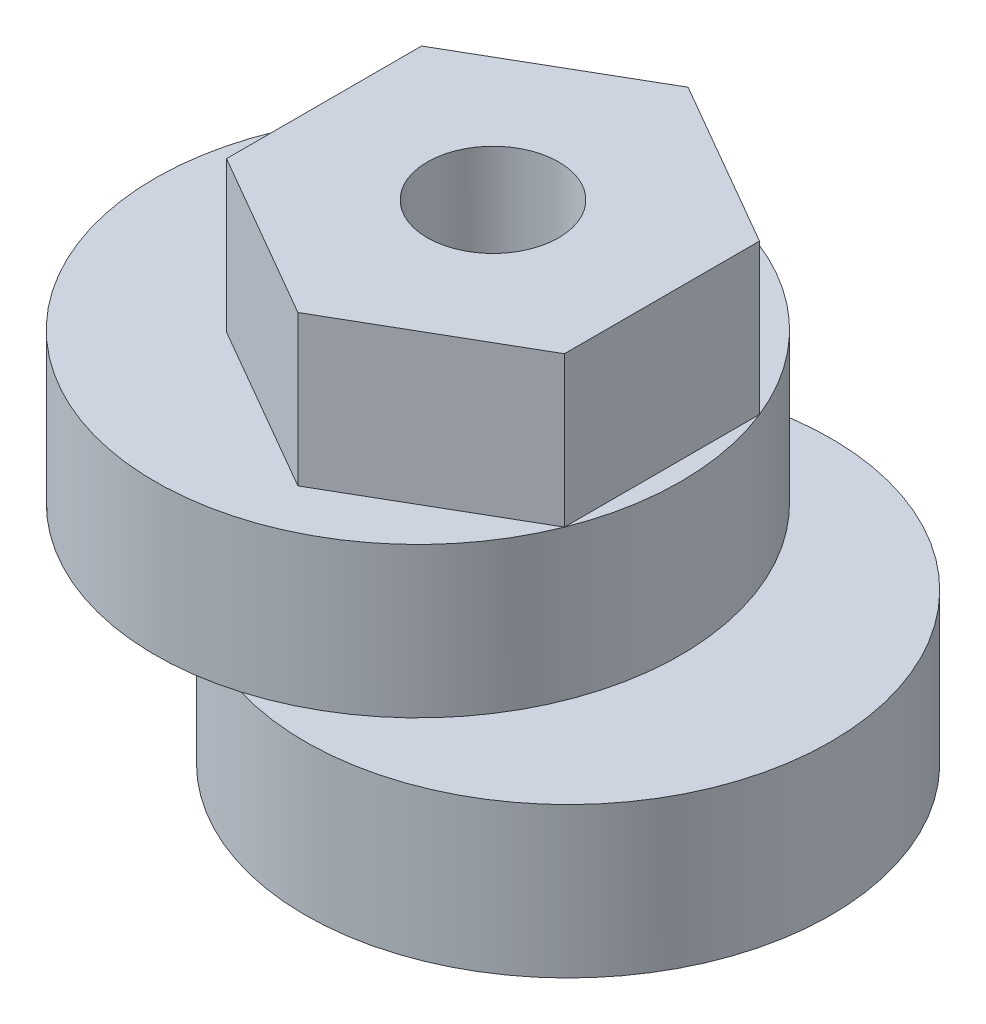
ISO-10303-21;
HEADER;
FILE_DESCRIPTION(('STEP AP214'),'2;1');
FILE_NAME('part.step','',(''),(''),'','','');
FILE_SCHEMA(('AUTOMOTIVE_DESIGN { 1 0 10303 214 1 1 1 1 }'));
ENDSEC;
DATA;
#1=APPLICATION_CONTEXT('core data for automotive mechanical design processes');
#2=APPLICATION_PROTOCOL_DEFINITION('international standard','automotive_design',2000,#1);
#3=PRODUCT_CONTEXT('',#1,'mechanical');
#4=PRODUCT('Part','Part','',(#3));
#5=PRODUCT_RELATED_PRODUCT_CATEGORY('part','',(#4));
#6=PRODUCT_DEFINITION_FORMATION('','',#4);
#7=PRODUCT_DEFINITION_CONTEXT('part definition',#1,'design');
#8=PRODUCT_DEFINITION('design','',#6,#7);
#9=PRODUCT_DEFINITION_SHAPE('','',#8);
#10=(LENGTH_UNIT() NAMED_UNIT(*) SI_UNIT(.MILLI.,.METRE.));
#11=(NAMED_UNIT(*) PLANE_ANGLE_UNIT() SI_UNIT($,.RADIAN.));
#12=(NAMED_UNIT(*) SI_UNIT($,.STERADIAN.) SOLID_ANGLE_UNIT());
#13=UNCERTAINTY_MEASURE_WITH_UNIT(LENGTH_MEASURE(1.E-05),#10,'distance_accuracy_value','');
#14=(GEOMETRIC_REPRESENTATION_CONTEXT(3) GLOBAL_UNCERTAINTY_ASSIGNED_CONTEXT((#13)) GLOBAL_UNIT_ASSIGNED_CONTEXT((#10,
#11,#12)) REPRESENTATION_CONTEXT('',''));
#15=CARTESIAN_POINT('',(0.,0.,0.));
#16=DIRECTION('',(0.,0.,1.));
#17=DIRECTION('',(1.,0.,0.));
#18=AXIS2_PLACEMENT_3D('',#15,#16,#17);
#19=CARTESIAN_POINT('',(-2.,10.,0.));
#20=DIRECTION('',(0.,1.,0.));
#21=DIRECTION('',(0.,0.,1.));
#22=AXIS2_PLACEMENT_3D('',#19,#20,#21);
#23=PLANE('',#22);
#24=DIRECTION('',(-0.866025403784439,0.,0.5));
#25=VECTOR('',#24,1.);
#26=CARTESIAN_POINT('',(0.,10.,-5.19615242270663));
#27=LINE('',#26,#25);
#28=CARTESIAN_POINT('',(0.,10.,-5.19615242270663));
#29=VERTEX_POINT('',#28);
#30=CARTESIAN_POINT('',(-4.5,10.,-2.59807621135332));
#31=VERTEX_POINT('',#30);
#32=EDGE_CURVE('E54',#29,#31,#27,.T.);
#33=ORIENTED_EDGE('',*,*,#32,.F.);
#34=DIRECTION('',(-0.866025403784439,0.,-0.5));
#35=VECTOR('',#34,1.);
#36=CARTESIAN_POINT('',(4.5,10.,-2.59807621135332));
#37=LINE('',#36,#35);
#38=CARTESIAN_POINT('',(4.5,10.,-2.59807621135332));
#39=VERTEX_POINT('',#38);
#40=EDGE_CURVE('E122',#39,#29,#37,.T.);
#41=ORIENTED_EDGE('',*,*,#40,.F.);
#42=CARTESIAN_POINT('',(-2.,10.,0.));
#43=DIRECTION('',(0.,1.,0.));
#44=DIRECTION('',(0.,0.,1.));
#45=AXIS2_PLACEMENT_3D('',#42,#43,#44);
#46=CIRCLE('',#45,7.);
#47=CARTESIAN_POINT('',(4.5,10.,2.59807621135332));
#48=VERTEX_POINT('',#47);
#49=EDGE_CURVE('E138',#39,#48,#46,.T.);
#50=ORIENTED_EDGE('',*,*,#49,.T.);
#51=DIRECTION('',(0.866025403784439,0.,-0.499999999999999));
#52=VECTOR('',#51,1.);
#53=CARTESIAN_POINT('',(0.,10.,5.19615242270663));
#54=LINE('',#53,#52);
#55=CARTESIAN_POINT('',(0.,10.,5.19615242270663));
#56=VERTEX_POINT('',#55);
#57=EDGE_CURVE('E61',#56,#48,#54,.T.);
#58=ORIENTED_EDGE('',*,*,#57,.F.);
#59=DIRECTION('',(0.866025403784439,0.,0.5));
#60=VECTOR('',#59,1.);
#61=CARTESIAN_POINT('',(-4.5,10.,2.59807621135332));
#62=LINE('',#61,#60);
#63=CARTESIAN_POINT('',(-4.5,10.,2.59807621135332));
#64=VERTEX_POINT('',#63);
#65=EDGE_CURVE('E397',#64,#56,#62,.T.);
#66=ORIENTED_EDGE('',*,*,#65,.F.);
#67=DIRECTION('',(0.,0.,1.));
#68=VECTOR('',#67,1.);
#69=CARTESIAN_POINT('',(-4.5,10.,-2.59807621135332));
#70=LINE('',#69,#68);
#71=EDGE_CURVE('E386',#31,#64,#70,.T.);
#72=ORIENTED_EDGE('',*,*,#71,.F.);
#73=EDGE_LOOP('',(#33,#41,#50,#58,#66,#72));
#74=FACE_BOUND('',#73,.T.);
#75=ADVANCED_FACE('F39',(#74),#23,.T.);
#76=CARTESIAN_POINT('',(0.,2.,0.));
#77=DIRECTION('',(0.,-1.,0.));
#78=DIRECTION('',(0.,0.,-1.));
#79=AXIS2_PLACEMENT_3D('',#76,#77,#78);
#80=CYLINDRICAL_SURFACE('',#79,5.);
#81=CARTESIAN_POINT('',(0.,2.,0.));
#82=DIRECTION('',(0.,1.,0.));
#83=DIRECTION('',(0.,0.,1.));
#84=AXIS2_PLACEMENT_3D('',#81,#82,#83);
#85=CIRCLE('',#84,5.);
#86=CARTESIAN_POINT('',(-5.,2.,0.));
#87=VERTEX_POINT('',#86);
#88=EDGE_CURVE('E11',#87,#87,#85,.T.);
#89=ORIENTED_EDGE('',*,*,#88,.F.);
#90=EDGE_LOOP('',(#89));
#91=FACE_BOUND('',#90,.T.);
#92=CARTESIAN_POINT('',(0.,0.,0.));
#93=DIRECTION('',(0.,1.,0.));
#94=DIRECTION('',(0.,0.,1.));
#95=AXIS2_PLACEMENT_3D('',#92,#93,#94);
#96=CIRCLE('',#95,5.);
#97=CARTESIAN_POINT('',(0.,0.,5.));
#98=VERTEX_POINT('',#97);
#99=EDGE_CURVE('E43',#98,#98,#96,.T.);
#100=ORIENTED_EDGE('',*,*,#99,.T.);
#101=EDGE_LOOP('',(#100));
#102=FACE_BOUND('',#101,.T.);
#103=ADVANCED_FACE('F41',(#91,#102),#80,.T.);
#104=CARTESIAN_POINT('',(0.,0.,0.));
#105=DIRECTION('',(0.,1.,0.));
#106=DIRECTION('',(0.,0.,1.));
#107=AXIS2_PLACEMENT_3D('',#104,#105,#106);
#108=PLANE('',#107);
#109=CARTESIAN_POINT('',(0.,0.,0.));
#110=DIRECTION('',(0.,-1.,0.));
#111=DIRECTION('',(0.,0.,-1.));
#112=AXIS2_PLACEMENT_3D('',#109,#110,#111);
#113=CIRCLE('',#112,1.75);
#114=CARTESIAN_POINT('',(0.,0.,-1.75));
#115=VERTEX_POINT('',#114);
#116=EDGE_CURVE('E125',#115,#115,#113,.T.);
#117=ORIENTED_EDGE('',*,*,#116,.F.);
#118=EDGE_LOOP('',(#117));
#119=FACE_BOUND('',#118,.T.);
#120=ORIENTED_EDGE('',*,*,#99,.F.);
#121=EDGE_LOOP('',(#120));
#122=FACE_BOUND('',#121,.T.);
#123=ADVANCED_FACE('F179',(#119,#122),#108,.F.);
#124=CARTESIAN_POINT('',(2.,6.,0.));
#125=DIRECTION('',(0.,-1.,0.));
#126=DIRECTION('',(0.,0.,-1.));
#127=AXIS2_PLACEMENT_3D('',#124,#125,#126);
#128=CYLINDRICAL_SURFACE('',#127,7.);
#129=CARTESIAN_POINT('',(2.,6.,0.));
#130=DIRECTION('',(0.,1.,0.));
#131=DIRECTION('',(0.,0.,1.));
#132=AXIS2_PLACEMENT_3D('',#129,#130,#131);
#133=CIRCLE('',#132,7.);
#134=CARTESIAN_POINT('',(0.,6.,-6.70820393249937));
#135=VERTEX_POINT('',#134);
#136=CARTESIAN_POINT('',(0.,6.,6.70820393249937));
#137=VERTEX_POINT('',#136);
#138=EDGE_CURVE('E142',#135,#137,#133,.T.);
#139=ORIENTED_EDGE('',*,*,#138,.F.);
#140=EDGE_CURVE('E145',#137,#135,#133,.T.);
#141=ORIENTED_EDGE('',*,*,#140,.F.);
#142=EDGE_LOOP('',(#139,#141));
#143=FACE_BOUND('',#142,.T.);
#144=CARTESIAN_POINT('',(2.,2.,0.));
#145=DIRECTION('',(0.,1.,0.));
#146=DIRECTION('',(0.,0.,1.));
#147=AXIS2_PLACEMENT_3D('',#144,#145,#146);
#148=CIRCLE('',#147,7.);
#149=EDGE_CURVE('E137',#87,#87,#148,.T.);
#150=ORIENTED_EDGE('',*,*,#149,.T.);
#151=EDGE_LOOP('',(#150));
#152=FACE_BOUND('',#151,.T.);
#153=ADVANCED_FACE('F309',(#143,#152),#128,.T.);
#154=CARTESIAN_POINT('',(2.,6.,0.));
#155=DIRECTION('',(0.,1.,0.));
#156=DIRECTION('',(0.,0.,1.));
#157=AXIS2_PLACEMENT_3D('',#154,#155,#156);
#158=PLANE('',#157);
#159=CARTESIAN_POINT('',(-2.,6.,0.));
#160=DIRECTION('',(0.,1.,0.));
#161=DIRECTION('',(0.,0.,1.));
#162=AXIS2_PLACEMENT_3D('',#159,#160,#161);
#163=CIRCLE('',#162,7.);
#164=EDGE_CURVE('E139',#137,#135,#163,.T.);
#165=ORIENTED_EDGE('',*,*,#164,.F.);
#166=ORIENTED_EDGE('',*,*,#140,.T.);
#167=EDGE_LOOP('',(#165,#166));
#168=FACE_BOUND('',#167,.T.);
#169=ADVANCED_FACE('F153',(#168),#158,.T.);
#170=CARTESIAN_POINT('',(2.,2.,0.));
#171=DIRECTION('',(0.,1.,0.));
#172=DIRECTION('',(0.,0.,1.));
#173=AXIS2_PLACEMENT_3D('',#170,#171,#172);
#174=PLANE('',#173);
#175=ORIENTED_EDGE('',*,*,#149,.F.);
#176=ORIENTED_EDGE('',*,*,#88,.T.);
#177=EDGE_LOOP('',(#175,#176));
#178=FACE_BOUND('',#177,.T.);
#179=ADVANCED_FACE('F171',(#178),#174,.F.);
#180=CARTESIAN_POINT('',(-2.,6.,0.));
#181=DIRECTION('',(0.,1.,0.));
#182=DIRECTION('',(0.,0.,1.));
#183=AXIS2_PLACEMENT_3D('',#180,#181,#182);
#184=PLANE('',#183);
#185=EDGE_CURVE('E128',#135,#137,#163,.T.);
#186=ORIENTED_EDGE('',*,*,#185,.F.);
#187=ORIENTED_EDGE('',*,*,#138,.T.);
#188=EDGE_LOOP('',(#186,#187));
#189=FACE_BOUND('',#188,.T.);
#190=ADVANCED_FACE('F157',(#189),#184,.F.);
#191=CARTESIAN_POINT('',(-2.,10.,0.));
#192=DIRECTION('',(0.,-1.,0.));
#193=DIRECTION('',(0.,0.,-1.));
#194=AXIS2_PLACEMENT_3D('',#191,#192,#193);
#195=CYLINDRICAL_SURFACE('',#194,7.);
#196=EDGE_CURVE('E134',#48,#39,#46,.T.);
#197=ORIENTED_EDGE('',*,*,#196,.F.);
#198=ORIENTED_EDGE('',*,*,#49,.F.);
#199=EDGE_LOOP('',(#197,#198));
#200=FACE_BOUND('',#199,.T.);
#201=ORIENTED_EDGE('',*,*,#164,.T.);
#202=ORIENTED_EDGE('',*,*,#185,.T.);
#203=EDGE_LOOP('',(#201,#202));
#204=FACE_BOUND('',#203,.T.);
#205=ADVANCED_FACE('F159',(#200,#204),#195,.T.);
#206=DIRECTION('',(0.,0.,-1.));
#207=VECTOR('',#206,1.);
#208=CARTESIAN_POINT('',(4.5,10.,2.59807621135332));
#209=LINE('',#208,#207);
#210=EDGE_CURVE('E400',#48,#39,#209,.T.);
#211=ORIENTED_EDGE('',*,*,#210,.F.);
#212=ORIENTED_EDGE('',*,*,#196,.T.);
#213=EDGE_LOOP('',(#211,#212));
#214=FACE_BOUND('',#213,.T.);
#215=ADVANCED_FACE('F161',(#214),#23,.T.);
#216=CARTESIAN_POINT('',(0.,10.,0.));
#217=DIRECTION('',(0.,-1.,0.));
#218=DIRECTION('',(0.,0.,-1.));
#219=AXIS2_PLACEMENT_3D('',#216,#217,#218);
#220=CYLINDRICAL_SURFACE('',#219,1.75);
#221=ORIENTED_EDGE('',*,*,#116,.T.);
#222=EDGE_LOOP('',(#221));
#223=FACE_BOUND('',#222,.T.);
#224=CARTESIAN_POINT('',(0.,14.,0.));
#225=DIRECTION('',(0.,1.,0.));
#226=DIRECTION('',(0.,0.,1.));
#227=AXIS2_PLACEMENT_3D('',#224,#225,#226);
#228=CIRCLE('',#227,1.75);
#229=CARTESIAN_POINT('',(0.,14.,1.75));
#230=VERTEX_POINT('',#229);
#231=EDGE_CURVE('E384',#230,#230,#228,.T.);
#232=ORIENTED_EDGE('',*,*,#231,.T.);
#233=EDGE_LOOP('',(#232));
#234=FACE_BOUND('',#233,.T.);
#235=ADVANCED_FACE('F168',(#223,#234),#220,.F.);
#236=CARTESIAN_POINT('',(0.,14.,0.));
#237=DIRECTION('',(0.,1.,0.));
#238=DIRECTION('',(0.,0.,1.));
#239=AXIS2_PLACEMENT_3D('',#236,#237,#238);
#240=PLANE('',#239);
#241=DIRECTION('',(-0.866025403784439,0.,0.5));
#242=VECTOR('',#241,1.);
#243=CARTESIAN_POINT('',(0.,14.,-5.19615242270663));
#244=LINE('',#243,#242);
#245=CARTESIAN_POINT('',(0.,14.,-5.19615242270663));
#246=VERTEX_POINT('',#245);
#247=CARTESIAN_POINT('',(-4.5,14.,-2.59807621135332));
#248=VERTEX_POINT('',#247);
#249=EDGE_CURVE('E112',#246,#248,#244,.T.);
#250=ORIENTED_EDGE('',*,*,#249,.T.);
#251=DIRECTION('',(0.,0.,1.));
#252=VECTOR('',#251,1.);
#253=CARTESIAN_POINT('',(-4.5,14.,-2.59807621135332));
#254=LINE('',#253,#252);
#255=CARTESIAN_POINT('',(-4.5,14.,2.59807621135332));
#256=VERTEX_POINT('',#255);
#257=EDGE_CURVE('E101',#248,#256,#254,.T.);
#258=ORIENTED_EDGE('',*,*,#257,.T.);
#259=DIRECTION('',(0.866025403784439,0.,0.5));
#260=VECTOR('',#259,1.);
#261=CARTESIAN_POINT('',(-4.5,14.,2.59807621135332));
#262=LINE('',#261,#260);
#263=CARTESIAN_POINT('',(0.,14.,5.19615242270663));
#264=VERTEX_POINT('',#263);
#265=EDGE_CURVE('E111',#256,#264,#262,.T.);
#266=ORIENTED_EDGE('',*,*,#265,.T.);
#267=DIRECTION('',(0.866025403784439,0.,-0.499999999999999));
#268=VECTOR('',#267,1.);
#269=CARTESIAN_POINT('',(0.,14.,5.19615242270663));
#270=LINE('',#269,#268);
#271=CARTESIAN_POINT('',(4.5,14.,2.59807621135332));
#272=VERTEX_POINT('',#271);
#273=EDGE_CURVE('E390',#264,#272,#270,.T.);
#274=ORIENTED_EDGE('',*,*,#273,.T.);
#275=DIRECTION('',(0.,0.,-1.));
#276=VECTOR('',#275,1.);
#277=CARTESIAN_POINT('',(4.5,14.,2.59807621135332));
#278=LINE('',#277,#276);
#279=CARTESIAN_POINT('',(4.5,14.,-2.59807621135332));
#280=VERTEX_POINT('',#279);
#281=EDGE_CURVE('E392',#272,#280,#278,.T.);
#282=ORIENTED_EDGE('',*,*,#281,.T.);
#283=DIRECTION('',(-0.866025403784439,0.,-0.5));
#284=VECTOR('',#283,1.);
#285=CARTESIAN_POINT('',(4.5,14.,-2.59807621135332));
#286=LINE('',#285,#284);
#287=EDGE_CURVE('E118',#280,#246,#286,.T.);
#288=ORIENTED_EDGE('',*,*,#287,.T.);
#289=EDGE_LOOP('',(#250,#258,#266,#274,#282,#288));
#290=FACE_BOUND('',#289,.T.);
#291=ORIENTED_EDGE('',*,*,#231,.F.);
#292=EDGE_LOOP('',(#291));
#293=FACE_BOUND('',#292,.T.);
#294=ADVANCED_FACE('F115',(#290,#293),#240,.T.);
#295=CARTESIAN_POINT('',(0.,14.,-5.19615242270663));
#296=DIRECTION('',(0.5,0.,0.866025403784439));
#297=DIRECTION('',(0.866025403784439,0.,-0.5));
#298=AXIS2_PLACEMENT_3D('',#295,#296,#297);
#299=PLANE('',#298);
#300=ORIENTED_EDGE('',*,*,#32,.T.);
#301=DIRECTION('',(0.,-1.,0.));
#302=VECTOR('',#301,1.);
#303=CARTESIAN_POINT('',(-4.5,14.,-2.59807621135332));
#304=LINE('',#303,#302);
#305=EDGE_CURVE('E106',#248,#31,#304,.T.);
#306=ORIENTED_EDGE('',*,*,#305,.F.);
#307=ORIENTED_EDGE('',*,*,#249,.F.);
#308=DIRECTION('',(0.,-1.,0.));
#309=VECTOR('',#308,1.);
#310=CARTESIAN_POINT('',(0.,14.,-5.19615242270663));
#311=LINE('',#310,#309);
#312=EDGE_CURVE('E394',#246,#29,#311,.T.);
#313=ORIENTED_EDGE('',*,*,#312,.T.);
#314=EDGE_LOOP('',(#300,#306,#307,#313));
#315=FACE_BOUND('',#314,.T.);
#316=ADVANCED_FACE('F124',(#315),#299,.F.);
#317=CARTESIAN_POINT('',(-4.5,14.,-2.59807621135332));
#318=DIRECTION('',(1.,0.,0.));
#319=DIRECTION('',(0.,0.,-1.));
#320=AXIS2_PLACEMENT_3D('',#317,#318,#319);
#321=PLANE('',#320);
#322=ORIENTED_EDGE('',*,*,#71,.T.);
#323=DIRECTION('',(0.,-1.,0.));
#324=VECTOR('',#323,1.);
#325=CARTESIAN_POINT('',(-4.5,14.,2.59807621135332));
#326=LINE('',#325,#324);
#327=EDGE_CURVE('E108',#256,#64,#326,.T.);
#328=ORIENTED_EDGE('',*,*,#327,.F.);
#329=ORIENTED_EDGE('',*,*,#257,.F.);
#330=ORIENTED_EDGE('',*,*,#305,.T.);
#331=EDGE_LOOP('',(#322,#328,#329,#330));
#332=FACE_BOUND('',#331,.T.);
#333=ADVANCED_FACE('F104',(#332),#321,.F.);
#334=CARTESIAN_POINT('',(-4.5,14.,2.59807621135332));
#335=DIRECTION('',(0.5,0.,-0.866025403784439));
#336=DIRECTION('',(-0.866025403784439,0.,-0.5));
#337=AXIS2_PLACEMENT_3D('',#334,#335,#336);
#338=PLANE('',#337);
#339=ORIENTED_EDGE('',*,*,#65,.T.);
#340=DIRECTION('',(0.,-1.,0.));
#341=VECTOR('',#340,1.);
#342=CARTESIAN_POINT('',(0.,14.,5.19615242270663));
#343=LINE('',#342,#341);
#344=EDGE_CURVE('E130',#264,#56,#343,.T.);
#345=ORIENTED_EDGE('',*,*,#344,.F.);
#346=ORIENTED_EDGE('',*,*,#265,.F.);
#347=ORIENTED_EDGE('',*,*,#327,.T.);
#348=EDGE_LOOP('',(#339,#345,#346,#347));
#349=FACE_BOUND('',#348,.T.);
#350=ADVANCED_FACE('F189',(#349),#338,.F.);
#351=CARTESIAN_POINT('',(0.,14.,5.19615242270663));
#352=DIRECTION('',(-0.5,0.,-0.866025403784439));
#353=DIRECTION('',(-0.866025403784439,0.,0.499999999999999));
#354=AXIS2_PLACEMENT_3D('',#351,#352,#353);
#355=PLANE('',#354);
#356=ORIENTED_EDGE('',*,*,#57,.T.);
#357=DIRECTION('',(0.,-1.,0.));
#358=VECTOR('',#357,1.);
#359=CARTESIAN_POINT('',(4.5,14.,2.59807621135332));
#360=LINE('',#359,#358);
#361=EDGE_CURVE('E408',#272,#48,#360,.T.);
#362=ORIENTED_EDGE('',*,*,#361,.F.);
#363=ORIENTED_EDGE('',*,*,#273,.F.);
#364=ORIENTED_EDGE('',*,*,#344,.T.);
#365=EDGE_LOOP('',(#356,#362,#363,#364));
#366=FACE_BOUND('',#365,.T.);
#367=ADVANCED_FACE('F192',(#366),#355,.F.);
#368=CARTESIAN_POINT('',(4.5,14.,2.59807621135332));
#369=DIRECTION('',(-1.,0.,0.));
#370=DIRECTION('',(0.,0.,1.));
#371=AXIS2_PLACEMENT_3D('',#368,#369,#370);
#372=PLANE('',#371);
#373=ORIENTED_EDGE('',*,*,#210,.T.);
#374=DIRECTION('',(0.,-1.,0.));
#375=VECTOR('',#374,1.);
#376=CARTESIAN_POINT('',(4.5,14.,-2.59807621135332));
#377=LINE('',#376,#375);
#378=EDGE_CURVE('E405',#280,#39,#377,.T.);
#379=ORIENTED_EDGE('',*,*,#378,.F.);
#380=ORIENTED_EDGE('',*,*,#281,.F.);
#381=ORIENTED_EDGE('',*,*,#361,.T.);
#382=EDGE_LOOP('',(#373,#379,#380,#381));
#383=FACE_BOUND('',#382,.T.);
#384=ADVANCED_FACE('F196',(#383),#372,.F.);
#385=CARTESIAN_POINT('',(4.5,14.,-2.59807621135332));
#386=DIRECTION('',(-0.5,0.,0.866025403784439));
#387=DIRECTION('',(0.866025403784439,0.,0.5));
#388=AXIS2_PLACEMENT_3D('',#385,#386,#387);
#389=PLANE('',#388);
#390=ORIENTED_EDGE('',*,*,#40,.T.);
#391=ORIENTED_EDGE('',*,*,#312,.F.);
#392=ORIENTED_EDGE('',*,*,#287,.F.);
#393=ORIENTED_EDGE('',*,*,#378,.T.);
#394=EDGE_LOOP('',(#390,#391,#392,#393));
#395=FACE_BOUND('',#394,.T.);
#396=ADVANCED_FACE('F200',(#395),#389,.F.);
#397=CLOSED_SHELL('',(#75,#103,#123,#153,#169,#179,#190,#205,#215,#235,#294,#316,#333,#350,#367,
#384,#396));
#398=MANIFOLD_SOLID_BREP('B2',#397);
#399=ADVANCED_BREP_SHAPE_REPRESENTATION('',(#18,#398),#14);
#400=SHAPE_DEFINITION_REPRESENTATION(#9,#399);
ENDSEC;
END-ISO-10303-21;
